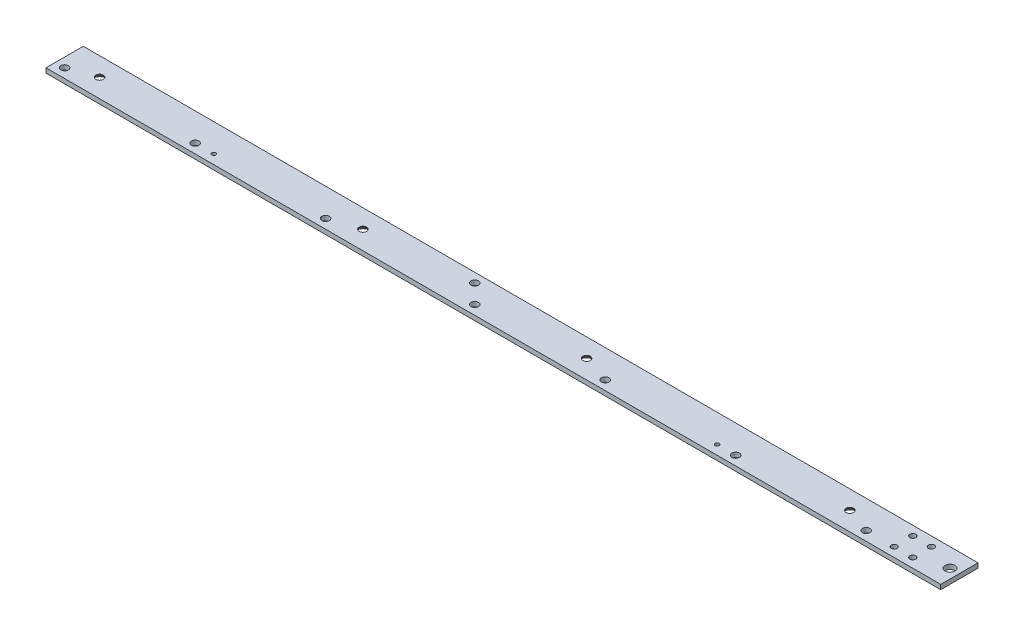
ISO-10303-21;
HEADER;
FILE_DESCRIPTION(('STEP AP214'),'2;1');
FILE_NAME('part.step','',(''),(''),'','','');
FILE_SCHEMA(('AUTOMOTIVE_DESIGN { 1 0 10303 214 1 1 1 1 }'));
ENDSEC;
DATA;
#1=APPLICATION_CONTEXT('core data for automotive mechanical design processes');
#2=APPLICATION_PROTOCOL_DEFINITION('international standard','automotive_design',2000,#1);
#3=PRODUCT_CONTEXT('',#1,'mechanical');
#4=PRODUCT('Part','Part','',(#3));
#5=PRODUCT_RELATED_PRODUCT_CATEGORY('part','',(#4));
#6=PRODUCT_DEFINITION_FORMATION('','',#4);
#7=PRODUCT_DEFINITION_CONTEXT('part definition',#1,'design');
#8=PRODUCT_DEFINITION('design','',#6,#7);
#9=PRODUCT_DEFINITION_SHAPE('','',#8);
#10=(LENGTH_UNIT() NAMED_UNIT(*) SI_UNIT(.MILLI.,.METRE.));
#11=(NAMED_UNIT(*) PLANE_ANGLE_UNIT() SI_UNIT($,.RADIAN.));
#12=(NAMED_UNIT(*) SI_UNIT($,.STERADIAN.) SOLID_ANGLE_UNIT());
#13=UNCERTAINTY_MEASURE_WITH_UNIT(LENGTH_MEASURE(1.E-05),#10,'distance_accuracy_value','');
#14=(GEOMETRIC_REPRESENTATION_CONTEXT(3) GLOBAL_UNCERTAINTY_ASSIGNED_CONTEXT((#13)) GLOBAL_UNIT_ASSIGNED_CONTEXT((#10,
#11,#12)) REPRESENTATION_CONTEXT('',''));
#15=CARTESIAN_POINT('',(0.,0.,0.));
#16=DIRECTION('',(0.,0.,1.));
#17=DIRECTION('',(1.,0.,0.));
#18=AXIS2_PLACEMENT_3D('',#15,#16,#17);
#19=CARTESIAN_POINT('',(279.4,1.5875,12.7));
#20=DIRECTION('',(0.,-1.,0.));
#21=DIRECTION('',(0.,0.,-1.));
#22=AXIS2_PLACEMENT_3D('',#19,#20,#21);
#23=PLANE('',#22);
#24=CARTESIAN_POINT('',(304.8,1.5875,-6.35));
#25=DIRECTION('',(0.,1.,0.));
#26=DIRECTION('',(0.,0.,1.));
#27=AXIS2_PLACEMENT_3D('',#24,#25,#26);
#28=CIRCLE('',#27,2.0193);
#29=CARTESIAN_POINT('',(304.8,1.5875,-4.3307));
#30=VERTEX_POINT('',#29);
#31=EDGE_CURVE('E335',#30,#30,#28,.T.);
#32=ORIENTED_EDGE('',*,*,#31,.F.);
#33=EDGE_LOOP('',(#32));
#34=FACE_BOUND('',#33,.T.);
#35=CARTESIAN_POINT('',(292.1,1.5875,-6.35));
#36=DIRECTION('',(0.,1.,0.));
#37=DIRECTION('',(0.,0.,1.));
#38=AXIS2_PLACEMENT_3D('',#35,#36,#37);
#39=CIRCLE('',#38,2.0193);
#40=CARTESIAN_POINT('',(292.1,1.5875,-4.3307));
#41=VERTEX_POINT('',#40);
#42=EDGE_CURVE('E337',#41,#41,#39,.T.);
#43=ORIENTED_EDGE('',*,*,#42,.F.);
#44=EDGE_LOOP('',(#43));
#45=FACE_BOUND('',#44,.T.);
#46=CARTESIAN_POINT('',(304.8,1.5875,6.35));
#47=DIRECTION('',(0.,1.,0.));
#48=DIRECTION('',(0.,0.,1.));
#49=AXIS2_PLACEMENT_3D('',#46,#47,#48);
#50=CIRCLE('',#49,2.0193);
#51=CARTESIAN_POINT('',(304.8,1.5875,8.3693));
#52=VERTEX_POINT('',#51);
#53=EDGE_CURVE('E345',#52,#52,#50,.T.);
#54=ORIENTED_EDGE('',*,*,#53,.F.);
#55=EDGE_LOOP('',(#54));
#56=FACE_BOUND('',#55,.T.);
#57=CARTESIAN_POINT('',(292.1,1.5875,6.35));
#58=DIRECTION('',(0.,1.,0.));
#59=DIRECTION('',(0.,0.,1.));
#60=AXIS2_PLACEMENT_3D('',#57,#58,#59);
#61=CIRCLE('',#60,2.0193);
#62=CARTESIAN_POINT('',(292.1,1.5875,8.3693));
#63=VERTEX_POINT('',#62);
#64=EDGE_CURVE('E351',#63,#63,#61,.T.);
#65=ORIENTED_EDGE('',*,*,#64,.F.);
#66=EDGE_LOOP('',(#65));
#67=FACE_BOUND('',#66,.T.);
#68=CARTESIAN_POINT('',(323.85,1.5875,0.));
#69=DIRECTION('',(0.,1.,0.));
#70=DIRECTION('',(0.,0.,1.));
#71=AXIS2_PLACEMENT_3D('',#68,#69,#70);
#72=CIRCLE('',#71,3.3782);
#73=CARTESIAN_POINT('',(323.85,1.5875,3.3782));
#74=VERTEX_POINT('',#73);
#75=EDGE_CURVE('E103',#74,#74,#72,.T.);
#76=ORIENTED_EDGE('',*,*,#75,.F.);
#77=EDGE_LOOP('',(#76));
#78=FACE_BOUND('',#77,.T.);
#79=CARTESIAN_POINT('',(-6.35,1.5875,-6.35));
#80=DIRECTION('',(0.,1.,0.));
#81=DIRECTION('',(0.,0.,1.));
#82=AXIS2_PLACEMENT_3D('',#79,#80,#81);
#83=CIRCLE('',#82,2.5527);
#84=CARTESIAN_POINT('',(-6.35,1.5875,-3.7973));
#85=VERTEX_POINT('',#84);
#86=EDGE_CURVE('E109',#85,#85,#83,.T.);
#87=ORIENTED_EDGE('',*,*,#86,.F.);
#88=EDGE_LOOP('',(#87));
#89=FACE_BOUND('',#88,.T.);
#90=CARTESIAN_POINT('',(255.5875,1.5875,0.));
#91=DIRECTION('',(0.,-1.,0.));
#92=DIRECTION('',(0.,0.,-1.));
#93=AXIS2_PLACEMENT_3D('',#90,#91,#92);
#94=CIRCLE('',#93,2.55270000000002);
#95=CARTESIAN_POINT('',(255.5875,1.5875,-2.55270000000002));
#96=VERTEX_POINT('',#95);
#97=EDGE_CURVE('E133',#96,#96,#94,.T.);
#98=ORIENTED_EDGE('',*,*,#97,.T.);
#99=EDGE_LOOP('',(#98));
#100=FACE_BOUND('',#99,.T.);
#101=CARTESIAN_POINT('',(76.2,1.5875,0.));
#102=DIRECTION('',(0.,-1.,0.));
#103=DIRECTION('',(0.,0.,-1.));
#104=AXIS2_PLACEMENT_3D('',#101,#102,#103);
#105=CIRCLE('',#104,2.55270000000001);
#106=CARTESIAN_POINT('',(76.2,1.5875,-2.55270000000001));
#107=VERTEX_POINT('',#106);
#108=EDGE_CURVE('E142',#107,#107,#105,.T.);
#109=ORIENTED_EDGE('',*,*,#108,.T.);
#110=EDGE_LOOP('',(#109));
#111=FACE_BOUND('',#110,.T.);
#112=CARTESIAN_POINT('',(184.15,1.5875,6.35));
#113=DIRECTION('',(0.,1.,0.));
#114=DIRECTION('',(0.,0.,1.));
#115=AXIS2_PLACEMENT_3D('',#112,#113,#114);
#116=CIRCLE('',#115,2.55269999999999);
#117=CARTESIAN_POINT('',(184.15,1.5875,8.90269999999999));
#118=VERTEX_POINT('',#117);
#119=EDGE_CURVE('E151',#118,#118,#116,.T.);
#120=ORIENTED_EDGE('',*,*,#119,.F.);
#121=EDGE_LOOP('',(#120));
#122=FACE_BOUND('',#121,.T.);
#123=CARTESIAN_POINT('',(95.25,1.5875,6.35));
#124=DIRECTION('',(0.,1.,0.));
#125=DIRECTION('',(0.,0.,1.));
#126=AXIS2_PLACEMENT_3D('',#123,#124,#125);
#127=CIRCLE('',#126,2.55269999999999);
#128=CARTESIAN_POINT('',(95.25,1.5875,8.90269999999999));
#129=VERTEX_POINT('',#128);
#130=EDGE_CURVE('E157',#129,#129,#127,.T.);
#131=ORIENTED_EDGE('',*,*,#130,.F.);
#132=EDGE_LOOP('',(#131));
#133=FACE_BOUND('',#132,.T.);
#134=CARTESIAN_POINT('',(-171.45,1.5875,6.35));
#135=DIRECTION('',(0.,1.,0.));
#136=DIRECTION('',(0.,0.,1.));
#137=AXIS2_PLACEMENT_3D('',#134,#135,#136);
#138=CIRCLE('',#137,1.35254999999998);
#139=CARTESIAN_POINT('',(-171.45,1.5875,7.70254999999998));
#140=VERTEX_POINT('',#139);
#141=EDGE_CURVE('E163',#140,#140,#138,.T.);
#142=ORIENTED_EDGE('',*,*,#141,.F.);
#143=EDGE_LOOP('',(#142));
#144=FACE_BOUND('',#143,.T.);
#145=CARTESIAN_POINT('',(-255.5875,1.5875,0.));
#146=DIRECTION('',(0.,-1.,0.));
#147=DIRECTION('',(0.,0.,-1.));
#148=AXIS2_PLACEMENT_3D('',#145,#146,#147);
#149=CIRCLE('',#148,2.55270000000002);
#150=CARTESIAN_POINT('',(-255.5875,1.5875,-2.55270000000002));
#151=VERTEX_POINT('',#150);
#152=EDGE_CURVE('E175',#151,#151,#149,.T.);
#153=ORIENTED_EDGE('',*,*,#152,.T.);
#154=EDGE_LOOP('',(#153));
#155=FACE_BOUND('',#154,.T.);
#156=CARTESIAN_POINT('',(-76.2,1.5875,0.));
#157=DIRECTION('',(0.,-1.,0.));
#158=DIRECTION('',(0.,0.,-1.));
#159=AXIS2_PLACEMENT_3D('',#156,#157,#158);
#160=CIRCLE('',#159,2.55270000000001);
#161=CARTESIAN_POINT('',(-76.2,1.5875,-2.55270000000001));
#162=VERTEX_POINT('',#161);
#163=EDGE_CURVE('E184',#162,#162,#160,.T.);
#164=ORIENTED_EDGE('',*,*,#163,.T.);
#165=EDGE_LOOP('',(#164));
#166=FACE_BOUND('',#165,.T.);
#167=CARTESIAN_POINT('',(-184.15,1.5875,6.35));
#168=DIRECTION('',(0.,1.,0.));
#169=DIRECTION('',(0.,0.,1.));
#170=AXIS2_PLACEMENT_3D('',#167,#168,#169);
#171=CIRCLE('',#170,2.55269999999999);
#172=CARTESIAN_POINT('',(-184.15,1.5875,8.90269999999999));
#173=VERTEX_POINT('',#172);
#174=EDGE_CURVE('E193',#173,#173,#171,.T.);
#175=ORIENTED_EDGE('',*,*,#174,.F.);
#176=EDGE_LOOP('',(#175));
#177=FACE_BOUND('',#176,.T.);
#178=CARTESIAN_POINT('',(-95.25,1.5875,6.35));
#179=DIRECTION('',(0.,1.,0.));
#180=DIRECTION('',(0.,0.,1.));
#181=AXIS2_PLACEMENT_3D('',#178,#179,#180);
#182=CIRCLE('',#181,2.55269999999999);
#183=CARTESIAN_POINT('',(-95.25,1.5875,8.90269999999999));
#184=VERTEX_POINT('',#183);
#185=EDGE_CURVE('E199',#184,#184,#182,.T.);
#186=ORIENTED_EDGE('',*,*,#185,.F.);
#187=EDGE_LOOP('',(#186));
#188=FACE_BOUND('',#187,.T.);
#189=DIRECTION('',(0.,0.,1.));
#190=VECTOR('',#189,1.);
#191=CARTESIAN_POINT('',(-279.4,1.5875,12.7));
#192=LINE('',#191,#190);
#193=CARTESIAN_POINT('',(-279.4,1.5875,-12.7));
#194=VERTEX_POINT('',#193);
#195=CARTESIAN_POINT('',(-279.4,1.5875,12.7));
#196=VERTEX_POINT('',#195);
#197=EDGE_CURVE('E86',#194,#196,#192,.T.);
#198=ORIENTED_EDGE('',*,*,#197,.T.);
#199=DIRECTION('',(-1.,0.,0.));
#200=VECTOR('',#199,1.);
#201=CARTESIAN_POINT('',(279.4,1.5875,12.7));
#202=LINE('',#201,#200);
#203=CARTESIAN_POINT('',(330.2,1.5875,12.7));
#204=VERTEX_POINT('',#203);
#205=EDGE_CURVE('E49',#204,#196,#202,.T.);
#206=ORIENTED_EDGE('',*,*,#205,.F.);
#207=DIRECTION('',(0.,0.,1.));
#208=VECTOR('',#207,1.);
#209=CARTESIAN_POINT('',(330.2,1.5875,-12.7));
#210=LINE('',#209,#208);
#211=CARTESIAN_POINT('',(330.2,1.5875,-12.7));
#212=VERTEX_POINT('',#211);
#213=EDGE_CURVE('E85',#212,#204,#210,.T.);
#214=ORIENTED_EDGE('',*,*,#213,.F.);
#215=DIRECTION('',(-1.,0.,0.));
#216=VECTOR('',#215,1.);
#217=CARTESIAN_POINT('',(279.4,1.5875,-12.7));
#218=LINE('',#217,#216);
#219=EDGE_CURVE('E11',#212,#194,#218,.T.);
#220=ORIENTED_EDGE('',*,*,#219,.T.);
#221=EDGE_LOOP('',(#198,#206,#214,#220));
#222=FACE_BOUND('',#221,.T.);
#223=CARTESIAN_POINT('',(-273.05,1.5875,6.35));
#224=DIRECTION('',(0.,1.,0.));
#225=DIRECTION('',(0.,0.,1.));
#226=AXIS2_PLACEMENT_3D('',#223,#224,#225);
#227=CIRCLE('',#226,2.55269999999996);
#228=CARTESIAN_POINT('',(-273.05,1.5875,8.90269999999996));
#229=VERTEX_POINT('',#228);
#230=EDGE_CURVE('E187',#229,#229,#227,.T.);
#231=ORIENTED_EDGE('',*,*,#230,.F.);
#232=EDGE_LOOP('',(#231));
#233=FACE_BOUND('',#232,.T.);
#234=CARTESIAN_POINT('',(273.05,1.5875,6.35));
#235=DIRECTION('',(0.,1.,0.));
#236=DIRECTION('',(0.,0.,1.));
#237=AXIS2_PLACEMENT_3D('',#234,#235,#236);
#238=CIRCLE('',#237,2.55269999999996);
#239=CARTESIAN_POINT('',(273.05,1.5875,8.90269999999996));
#240=VERTEX_POINT('',#239);
#241=EDGE_CURVE('E145',#240,#240,#238,.T.);
#242=ORIENTED_EDGE('',*,*,#241,.F.);
#243=EDGE_LOOP('',(#242));
#244=FACE_BOUND('',#243,.T.);
#245=CARTESIAN_POINT('',(171.45,1.5875,6.35));
#246=DIRECTION('',(0.,1.,0.));
#247=DIRECTION('',(0.,0.,1.));
#248=AXIS2_PLACEMENT_3D('',#245,#246,#247);
#249=CIRCLE('',#248,1.35254999999998);
#250=CARTESIAN_POINT('',(171.45,1.5875,7.70254999999998));
#251=VERTEX_POINT('',#250);
#252=EDGE_CURVE('E121',#251,#251,#249,.T.);
#253=ORIENTED_EDGE('',*,*,#252,.F.);
#254=EDGE_LOOP('',(#253));
#255=FACE_BOUND('',#254,.T.);
#256=CARTESIAN_POINT('',(6.35,1.5875,6.35));
#257=DIRECTION('',(0.,1.,0.));
#258=DIRECTION('',(0.,0.,1.));
#259=AXIS2_PLACEMENT_3D('',#256,#257,#258);
#260=CIRCLE('',#259,2.5527);
#261=CARTESIAN_POINT('',(6.35,1.5875,8.9027));
#262=VERTEX_POINT('',#261);
#263=EDGE_CURVE('E115',#262,#262,#260,.T.);
#264=ORIENTED_EDGE('',*,*,#263,.F.);
#265=EDGE_LOOP('',(#264));
#266=FACE_BOUND('',#265,.T.);
#267=ADVANCED_FACE('F41',(#34,#45,#56,#67,#78,#89,#100,#111,#122,#133,#144,#155,#166,#177,#188,
#222,#233,#244,#255,#266),#23,.F.);
#268=CARTESIAN_POINT('',(279.4,1.5875,-12.7));
#269=DIRECTION('',(0.,0.,1.));
#270=DIRECTION('',(1.,0.,0.));
#271=AXIS2_PLACEMENT_3D('',#268,#269,#270);
#272=PLANE('',#271);
#273=DIRECTION('',(0.,1.,0.));
#274=VECTOR('',#273,1.);
#275=CARTESIAN_POINT('',(-279.4,1.5875,-12.7));
#276=LINE('',#275,#274);
#277=CARTESIAN_POINT('',(-279.4,-1.5875,-12.7));
#278=VERTEX_POINT('',#277);
#279=EDGE_CURVE('E205',#278,#194,#276,.T.);
#280=ORIENTED_EDGE('',*,*,#279,.T.);
#281=ORIENTED_EDGE('',*,*,#219,.F.);
#282=DIRECTION('',(0.,1.,0.));
#283=VECTOR('',#282,1.);
#284=CARTESIAN_POINT('',(330.2,-1.5875,-12.7));
#285=LINE('',#284,#283);
#286=CARTESIAN_POINT('',(330.2,-1.5875,-12.7));
#287=VERTEX_POINT('',#286);
#288=EDGE_CURVE('E99',#287,#212,#285,.T.);
#289=ORIENTED_EDGE('',*,*,#288,.F.);
#290=DIRECTION('',(-1.,0.,0.));
#291=VECTOR('',#290,1.);
#292=CARTESIAN_POINT('',(279.4,-1.5875,-12.7));
#293=LINE('',#292,#291);
#294=EDGE_CURVE('E211',#287,#278,#293,.T.);
#295=ORIENTED_EDGE('',*,*,#294,.T.);
#296=EDGE_LOOP('',(#280,#281,#289,#295));
#297=FACE_BOUND('',#296,.T.);
#298=ADVANCED_FACE('F43',(#297),#272,.F.);
#299=CARTESIAN_POINT('',(279.4,1.5875,12.7));
#300=DIRECTION('',(0.,0.,-1.));
#301=DIRECTION('',(-1.,0.,0.));
#302=AXIS2_PLACEMENT_3D('',#299,#300,#301);
#303=PLANE('',#302);
#304=DIRECTION('',(0.,-1.,0.));
#305=VECTOR('',#304,1.);
#306=CARTESIAN_POINT('',(-279.4,1.5875,12.7));
#307=LINE('',#306,#305);
#308=CARTESIAN_POINT('',(-279.4,-1.5875,12.7));
#309=VERTEX_POINT('',#308);
#310=EDGE_CURVE('E64',#196,#309,#307,.T.);
#311=ORIENTED_EDGE('',*,*,#310,.T.);
#312=DIRECTION('',(-1.,0.,0.));
#313=VECTOR('',#312,1.);
#314=CARTESIAN_POINT('',(279.4,-1.5875,12.7));
#315=LINE('',#314,#313);
#316=CARTESIAN_POINT('',(330.2,-1.5875,12.7));
#317=VERTEX_POINT('',#316);
#318=EDGE_CURVE('E87',#317,#309,#315,.T.);
#319=ORIENTED_EDGE('',*,*,#318,.F.);
#320=DIRECTION('',(0.,-1.,0.));
#321=VECTOR('',#320,1.);
#322=CARTESIAN_POINT('',(330.2,1.5875,12.7));
#323=LINE('',#322,#321);
#324=EDGE_CURVE('E89',#204,#317,#323,.T.);
#325=ORIENTED_EDGE('',*,*,#324,.F.);
#326=ORIENTED_EDGE('',*,*,#205,.T.);
#327=EDGE_LOOP('',(#311,#319,#325,#326));
#328=FACE_BOUND('',#327,.T.);
#329=ADVANCED_FACE('F90',(#328),#303,.F.);
#330=CARTESIAN_POINT('',(279.4,-1.5875,12.7));
#331=DIRECTION('',(0.,1.,0.));
#332=DIRECTION('',(0.,0.,1.));
#333=AXIS2_PLACEMENT_3D('',#330,#331,#332);
#334=PLANE('',#333);
#335=CARTESIAN_POINT('',(304.8,-1.5875,-6.35));
#336=DIRECTION('',(0.,1.,0.));
#337=DIRECTION('',(0.,0.,1.));
#338=AXIS2_PLACEMENT_3D('',#335,#336,#337);
#339=CIRCLE('',#338,2.0193);
#340=CARTESIAN_POINT('',(304.8,-1.5875,-4.3307));
#341=VERTEX_POINT('',#340);
#342=EDGE_CURVE('E333',#341,#341,#339,.T.);
#343=ORIENTED_EDGE('',*,*,#342,.T.);
#344=EDGE_LOOP('',(#343));
#345=FACE_BOUND('',#344,.T.);
#346=CARTESIAN_POINT('',(292.1,-1.5875,-6.35));
#347=DIRECTION('',(0.,1.,0.));
#348=DIRECTION('',(0.,0.,1.));
#349=AXIS2_PLACEMENT_3D('',#346,#347,#348);
#350=CIRCLE('',#349,2.0193);
#351=CARTESIAN_POINT('',(292.1,-1.5875,-4.3307));
#352=VERTEX_POINT('',#351);
#353=EDGE_CURVE('E342',#352,#352,#350,.T.);
#354=ORIENTED_EDGE('',*,*,#353,.T.);
#355=EDGE_LOOP('',(#354));
#356=FACE_BOUND('',#355,.T.);
#357=CARTESIAN_POINT('',(304.8,-1.5875,6.35));
#358=DIRECTION('',(0.,1.,0.));
#359=DIRECTION('',(0.,0.,1.));
#360=AXIS2_PLACEMENT_3D('',#357,#358,#359);
#361=CIRCLE('',#360,2.0193);
#362=CARTESIAN_POINT('',(304.8,-1.5875,8.3693));
#363=VERTEX_POINT('',#362);
#364=EDGE_CURVE('E348',#363,#363,#361,.T.);
#365=ORIENTED_EDGE('',*,*,#364,.T.);
#366=EDGE_LOOP('',(#365));
#367=FACE_BOUND('',#366,.T.);
#368=CARTESIAN_POINT('',(292.1,-1.5875,6.35));
#369=DIRECTION('',(0.,1.,0.));
#370=DIRECTION('',(0.,0.,1.));
#371=AXIS2_PLACEMENT_3D('',#368,#369,#370);
#372=CIRCLE('',#371,2.0193);
#373=CARTESIAN_POINT('',(292.1,-1.5875,8.3693));
#374=VERTEX_POINT('',#373);
#375=EDGE_CURVE('E354',#374,#374,#372,.T.);
#376=ORIENTED_EDGE('',*,*,#375,.T.);
#377=EDGE_LOOP('',(#376));
#378=FACE_BOUND('',#377,.T.);
#379=CARTESIAN_POINT('',(323.85,-1.5875,0.));
#380=DIRECTION('',(0.,1.,0.));
#381=DIRECTION('',(0.,0.,1.));
#382=AXIS2_PLACEMENT_3D('',#379,#380,#381);
#383=CIRCLE('',#382,3.3782);
#384=CARTESIAN_POINT('',(323.85,-1.5875,3.3782));
#385=VERTEX_POINT('',#384);
#386=EDGE_CURVE('E100',#385,#385,#383,.T.);
#387=ORIENTED_EDGE('',*,*,#386,.T.);
#388=EDGE_LOOP('',(#387));
#389=FACE_BOUND('',#388,.T.);
#390=CARTESIAN_POINT('',(-6.35,-1.5875,-6.35));
#391=DIRECTION('',(0.,1.,0.));
#392=DIRECTION('',(0.,0.,1.));
#393=AXIS2_PLACEMENT_3D('',#390,#391,#392);
#394=CIRCLE('',#393,2.5527);
#395=CARTESIAN_POINT('',(-6.35,-1.5875,-3.7973));
#396=VERTEX_POINT('',#395);
#397=EDGE_CURVE('E112',#396,#396,#394,.T.);
#398=ORIENTED_EDGE('',*,*,#397,.T.);
#399=EDGE_LOOP('',(#398));
#400=FACE_BOUND('',#399,.T.);
#401=CARTESIAN_POINT('',(6.35,-1.5875,6.35));
#402=DIRECTION('',(0.,1.,0.));
#403=DIRECTION('',(0.,0.,1.));
#404=AXIS2_PLACEMENT_3D('',#401,#402,#403);
#405=CIRCLE('',#404,2.5527);
#406=CARTESIAN_POINT('',(6.35,-1.5875,8.9027));
#407=VERTEX_POINT('',#406);
#408=EDGE_CURVE('E118',#407,#407,#405,.T.);
#409=ORIENTED_EDGE('',*,*,#408,.T.);
#410=EDGE_LOOP('',(#409));
#411=FACE_BOUND('',#410,.T.);
#412=CARTESIAN_POINT('',(171.45,-1.5875,6.35));
#413=DIRECTION('',(0.,1.,0.));
#414=DIRECTION('',(0.,0.,1.));
#415=AXIS2_PLACEMENT_3D('',#412,#413,#414);
#416=CIRCLE('',#415,1.35255000000001);
#417=CARTESIAN_POINT('',(171.45,-1.5875,7.70255000000001));
#418=VERTEX_POINT('',#417);
#419=EDGE_CURVE('E124',#418,#418,#416,.T.);
#420=ORIENTED_EDGE('',*,*,#419,.T.);
#421=EDGE_LOOP('',(#420));
#422=FACE_BOUND('',#421,.T.);
#423=CARTESIAN_POINT('',(255.5875,-1.5875,0.));
#424=DIRECTION('',(0.,-1.,0.));
#425=DIRECTION('',(0.,0.,-1.));
#426=AXIS2_PLACEMENT_3D('',#423,#424,#425);
#427=CIRCLE('',#426,4.88949999999999);
#428=CARTESIAN_POINT('',(255.5875,-1.5875,-4.88949999999999));
#429=VERTEX_POINT('',#428);
#430=EDGE_CURVE('E127',#429,#429,#427,.T.);
#431=ORIENTED_EDGE('',*,*,#430,.F.);
#432=EDGE_LOOP('',(#431));
#433=FACE_BOUND('',#432,.T.);
#434=CARTESIAN_POINT('',(76.2,-1.5875,0.));
#435=DIRECTION('',(0.,-1.,0.));
#436=DIRECTION('',(0.,0.,-1.));
#437=AXIS2_PLACEMENT_3D('',#434,#435,#436);
#438=CIRCLE('',#437,4.88950000000001);
#439=CARTESIAN_POINT('',(76.2,-1.5875,-4.88950000000001));
#440=VERTEX_POINT('',#439);
#441=EDGE_CURVE('E136',#440,#440,#438,.T.);
#442=ORIENTED_EDGE('',*,*,#441,.F.);
#443=EDGE_LOOP('',(#442));
#444=FACE_BOUND('',#443,.T.);
#445=CARTESIAN_POINT('',(273.05,-1.5875,6.35));
#446=DIRECTION('',(0.,1.,0.));
#447=DIRECTION('',(0.,0.,1.));
#448=AXIS2_PLACEMENT_3D('',#445,#446,#447);
#449=CIRCLE('',#448,2.55270000000002);
#450=CARTESIAN_POINT('',(273.05,-1.5875,8.90270000000002));
#451=VERTEX_POINT('',#450);
#452=EDGE_CURVE('E148',#451,#451,#449,.T.);
#453=ORIENTED_EDGE('',*,*,#452,.T.);
#454=EDGE_LOOP('',(#453));
#455=FACE_BOUND('',#454,.T.);
#456=CARTESIAN_POINT('',(184.15,-1.5875,6.35));
#457=DIRECTION('',(0.,1.,0.));
#458=DIRECTION('',(0.,0.,1.));
#459=AXIS2_PLACEMENT_3D('',#456,#457,#458);
#460=CIRCLE('',#459,2.55269999999999);
#461=CARTESIAN_POINT('',(184.15,-1.5875,8.90269999999999));
#462=VERTEX_POINT('',#461);
#463=EDGE_CURVE('E154',#462,#462,#460,.T.);
#464=ORIENTED_EDGE('',*,*,#463,.T.);
#465=EDGE_LOOP('',(#464));
#466=FACE_BOUND('',#465,.T.);
#467=CARTESIAN_POINT('',(95.25,-1.5875,6.35));
#468=DIRECTION('',(0.,1.,0.));
#469=DIRECTION('',(0.,0.,1.));
#470=AXIS2_PLACEMENT_3D('',#467,#468,#469);
#471=CIRCLE('',#470,2.55270000000001);
#472=CARTESIAN_POINT('',(95.25,-1.5875,8.9027));
#473=VERTEX_POINT('',#472);
#474=EDGE_CURVE('E160',#473,#473,#471,.T.);
#475=ORIENTED_EDGE('',*,*,#474,.T.);
#476=EDGE_LOOP('',(#475));
#477=FACE_BOUND('',#476,.T.);
#478=CARTESIAN_POINT('',(-171.45,-1.5875,6.35));
#479=DIRECTION('',(0.,1.,0.));
#480=DIRECTION('',(0.,0.,1.));
#481=AXIS2_PLACEMENT_3D('',#478,#479,#480);
#482=CIRCLE('',#481,1.35255000000001);
#483=CARTESIAN_POINT('',(-171.45,-1.5875,7.70255000000001));
#484=VERTEX_POINT('',#483);
#485=EDGE_CURVE('E166',#484,#484,#482,.T.);
#486=ORIENTED_EDGE('',*,*,#485,.T.);
#487=EDGE_LOOP('',(#486));
#488=FACE_BOUND('',#487,.T.);
#489=CARTESIAN_POINT('',(-255.5875,-1.5875,0.));
#490=DIRECTION('',(0.,-1.,0.));
#491=DIRECTION('',(0.,0.,-1.));
#492=AXIS2_PLACEMENT_3D('',#489,#490,#491);
#493=CIRCLE('',#492,4.88949999999999);
#494=CARTESIAN_POINT('',(-255.5875,-1.5875,-4.88949999999999));
#495=VERTEX_POINT('',#494);
#496=EDGE_CURVE('E169',#495,#495,#493,.T.);
#497=ORIENTED_EDGE('',*,*,#496,.F.);
#498=EDGE_LOOP('',(#497));
#499=FACE_BOUND('',#498,.T.);
#500=CARTESIAN_POINT('',(-76.2,-1.5875,0.));
#501=DIRECTION('',(0.,-1.,0.));
#502=DIRECTION('',(0.,0.,-1.));
#503=AXIS2_PLACEMENT_3D('',#500,#501,#502);
#504=CIRCLE('',#503,4.88950000000001);
#505=CARTESIAN_POINT('',(-76.2,-1.5875,-4.88950000000001));
#506=VERTEX_POINT('',#505);
#507=EDGE_CURVE('E178',#506,#506,#504,.T.);
#508=ORIENTED_EDGE('',*,*,#507,.F.);
#509=EDGE_LOOP('',(#508));
#510=FACE_BOUND('',#509,.T.);
#511=CARTESIAN_POINT('',(-273.05,-1.5875,6.35));
#512=DIRECTION('',(0.,1.,0.));
#513=DIRECTION('',(0.,0.,1.));
#514=AXIS2_PLACEMENT_3D('',#511,#512,#513);
#515=CIRCLE('',#514,2.55270000000002);
#516=CARTESIAN_POINT('',(-273.05,-1.5875,8.90270000000002));
#517=VERTEX_POINT('',#516);
#518=EDGE_CURVE('E190',#517,#517,#515,.T.);
#519=ORIENTED_EDGE('',*,*,#518,.T.);
#520=EDGE_LOOP('',(#519));
#521=FACE_BOUND('',#520,.T.);
#522=CARTESIAN_POINT('',(-184.15,-1.5875,6.35));
#523=DIRECTION('',(0.,1.,0.));
#524=DIRECTION('',(0.,0.,1.));
#525=AXIS2_PLACEMENT_3D('',#522,#523,#524);
#526=CIRCLE('',#525,2.55269999999999);
#527=CARTESIAN_POINT('',(-184.15,-1.5875,8.90269999999999));
#528=VERTEX_POINT('',#527);
#529=EDGE_CURVE('E196',#528,#528,#526,.T.);
#530=ORIENTED_EDGE('',*,*,#529,.T.);
#531=EDGE_LOOP('',(#530));
#532=FACE_BOUND('',#531,.T.);
#533=CARTESIAN_POINT('',(-95.25,-1.5875,6.35));
#534=DIRECTION('',(0.,1.,0.));
#535=DIRECTION('',(0.,0.,1.));
#536=AXIS2_PLACEMENT_3D('',#533,#534,#535);
#537=CIRCLE('',#536,2.55270000000001);
#538=CARTESIAN_POINT('',(-95.25,-1.5875,8.9027));
#539=VERTEX_POINT('',#538);
#540=EDGE_CURVE('E202',#539,#539,#537,.T.);
#541=ORIENTED_EDGE('',*,*,#540,.T.);
#542=EDGE_LOOP('',(#541));
#543=FACE_BOUND('',#542,.T.);
#544=DIRECTION('',(0.,0.,-1.));
#545=VECTOR('',#544,1.);
#546=CARTESIAN_POINT('',(-279.4,-1.5875,12.7));
#547=LINE('',#546,#545);
#548=EDGE_CURVE('E56',#309,#278,#547,.T.);
#549=ORIENTED_EDGE('',*,*,#548,.T.);
#550=ORIENTED_EDGE('',*,*,#294,.F.);
#551=DIRECTION('',(0.,0.,-1.));
#552=VECTOR('',#551,1.);
#553=CARTESIAN_POINT('',(330.2,-1.5875,12.7));
#554=LINE('',#553,#552);
#555=EDGE_CURVE('E94',#317,#287,#554,.T.);
#556=ORIENTED_EDGE('',*,*,#555,.F.);
#557=ORIENTED_EDGE('',*,*,#318,.T.);
#558=EDGE_LOOP('',(#549,#550,#556,#557));
#559=FACE_BOUND('',#558,.T.);
#560=ADVANCED_FACE('F213',(#345,#356,#367,#378,#389,#400,#411,#422,#433,#444,#455,#466,#477,
#488,#499,#510,#521,#532,#543,#559),#334,.F.);
#561=CARTESIAN_POINT('',(-279.4,0.,0.));
#562=DIRECTION('',(1.,0.,0.));
#563=DIRECTION('',(0.,0.,-1.));
#564=AXIS2_PLACEMENT_3D('',#561,#562,#563);
#565=PLANE('',#564);
#566=ORIENTED_EDGE('',*,*,#279,.F.);
#567=ORIENTED_EDGE('',*,*,#548,.F.);
#568=ORIENTED_EDGE('',*,*,#310,.F.);
#569=ORIENTED_EDGE('',*,*,#197,.F.);
#570=EDGE_LOOP('',(#566,#567,#568,#569));
#571=FACE_BOUND('',#570,.T.);
#572=ADVANCED_FACE('F216',(#571),#565,.F.);
#573=CARTESIAN_POINT('',(-95.25,1.5875,6.35));
#574=DIRECTION('',(0.,1.,0.));
#575=DIRECTION('',(0.,0.,1.));
#576=AXIS2_PLACEMENT_3D('',#573,#574,#575);
#577=CYLINDRICAL_SURFACE('',#576,2.5527);
#578=ORIENTED_EDGE('',*,*,#540,.F.);
#579=EDGE_LOOP('',(#578));
#580=FACE_BOUND('',#579,.T.);
#581=ORIENTED_EDGE('',*,*,#185,.T.);
#582=EDGE_LOOP('',(#581));
#583=FACE_BOUND('',#582,.T.);
#584=ADVANCED_FACE('F235',(#580,#583),#577,.F.);
#585=CARTESIAN_POINT('',(-184.15,1.5875,6.35));
#586=DIRECTION('',(0.,1.,0.));
#587=DIRECTION('',(0.,0.,1.));
#588=AXIS2_PLACEMENT_3D('',#585,#586,#587);
#589=CYLINDRICAL_SURFACE('',#588,2.55269999999999);
#590=ORIENTED_EDGE('',*,*,#529,.F.);
#591=EDGE_LOOP('',(#590));
#592=FACE_BOUND('',#591,.T.);
#593=ORIENTED_EDGE('',*,*,#174,.T.);
#594=EDGE_LOOP('',(#593));
#595=FACE_BOUND('',#594,.T.);
#596=ADVANCED_FACE('F238',(#592,#595),#589,.F.);
#597=CARTESIAN_POINT('',(-273.05,1.5875,6.35));
#598=DIRECTION('',(0.,1.,0.));
#599=DIRECTION('',(0.,0.,1.));
#600=AXIS2_PLACEMENT_3D('',#597,#598,#599);
#601=CYLINDRICAL_SURFACE('',#600,2.55269999999999);
#602=ORIENTED_EDGE('',*,*,#518,.F.);
#603=EDGE_LOOP('',(#602));
#604=FACE_BOUND('',#603,.T.);
#605=ORIENTED_EDGE('',*,*,#230,.T.);
#606=EDGE_LOOP('',(#605));
#607=FACE_BOUND('',#606,.T.);
#608=ADVANCED_FACE('F242',(#604,#607),#601,.F.);
#609=CARTESIAN_POINT('',(-76.2,-1.5875,0.));
#610=DIRECTION('',(0.,-1.,0.));
#611=DIRECTION('',(0.,0.,-1.));
#612=AXIS2_PLACEMENT_3D('',#609,#610,#611);
#613=CYLINDRICAL_SURFACE('',#612,2.55270000000001);
#614=ORIENTED_EDGE('',*,*,#163,.F.);
#615=EDGE_LOOP('',(#614));
#616=FACE_BOUND('',#615,.T.);
#617=CARTESIAN_POINT('',(-76.2,1.10068089399406,0.));
#618=DIRECTION('',(0.,-1.,0.));
#619=DIRECTION('',(0.,0.,-1.));
#620=AXIS2_PLACEMENT_3D('',#617,#618,#619);
#621=CIRCLE('',#620,2.55270000000001);
#622=CARTESIAN_POINT('',(-76.2,1.10068089399406,-2.55270000000001));
#623=VERTEX_POINT('',#622);
#624=EDGE_CURVE('E181',#623,#623,#621,.T.);
#625=ORIENTED_EDGE('',*,*,#624,.T.);
#626=EDGE_LOOP('',(#625));
#627=FACE_BOUND('',#626,.T.);
#628=ADVANCED_FACE('F246',(#616,#627),#613,.F.);
#629=CARTESIAN_POINT('',(-76.2,-1.5875,0.));
#630=DIRECTION('',(0.,-1.,0.));
#631=DIRECTION('',(0.,0.,-1.));
#632=AXIS2_PLACEMENT_3D('',#629,#630,#631);
#633=CONICAL_SURFACE('',#632,4.88950000000001,0.715584993317675);
#634=ORIENTED_EDGE('',*,*,#624,.F.);
#635=EDGE_LOOP('',(#634));
#636=FACE_BOUND('',#635,.T.);
#637=ORIENTED_EDGE('',*,*,#507,.T.);
#638=EDGE_LOOP('',(#637));
#639=FACE_BOUND('',#638,.T.);
#640=ADVANCED_FACE('F250',(#636,#639),#633,.F.);
#641=CARTESIAN_POINT('',(-255.5875,-1.5875,0.));
#642=DIRECTION('',(0.,-1.,0.));
#643=DIRECTION('',(0.,0.,-1.));
#644=AXIS2_PLACEMENT_3D('',#641,#642,#643);
#645=CYLINDRICAL_SURFACE('',#644,2.55270000000002);
#646=ORIENTED_EDGE('',*,*,#152,.F.);
#647=EDGE_LOOP('',(#646));
#648=FACE_BOUND('',#647,.T.);
#649=CARTESIAN_POINT('',(-255.5875,1.10068089399406,0.));
#650=DIRECTION('',(0.,-1.,0.));
#651=DIRECTION('',(0.,0.,-1.));
#652=AXIS2_PLACEMENT_3D('',#649,#650,#651);
#653=CIRCLE('',#652,2.55270000000002);
#654=CARTESIAN_POINT('',(-255.5875,1.10068089399406,-2.55270000000002));
#655=VERTEX_POINT('',#654);
#656=EDGE_CURVE('E172',#655,#655,#653,.T.);
#657=ORIENTED_EDGE('',*,*,#656,.T.);
#658=EDGE_LOOP('',(#657));
#659=FACE_BOUND('',#658,.T.);
#660=ADVANCED_FACE('F254',(#648,#659),#645,.F.);
#661=CARTESIAN_POINT('',(-255.5875,-1.5875,0.));
#662=DIRECTION('',(0.,-1.,0.));
#663=DIRECTION('',(0.,0.,-1.));
#664=AXIS2_PLACEMENT_3D('',#661,#662,#663);
#665=CONICAL_SURFACE('',#664,4.88949999999999,0.715584993317669);
#666=ORIENTED_EDGE('',*,*,#656,.F.);
#667=EDGE_LOOP('',(#666));
#668=FACE_BOUND('',#667,.T.);
#669=ORIENTED_EDGE('',*,*,#496,.T.);
#670=EDGE_LOOP('',(#669));
#671=FACE_BOUND('',#670,.T.);
#672=ADVANCED_FACE('F258',(#668,#671),#665,.F.);
#673=CARTESIAN_POINT('',(-171.45,1.5875,6.35));
#674=DIRECTION('',(0.,1.,0.));
#675=DIRECTION('',(0.,0.,1.));
#676=AXIS2_PLACEMENT_3D('',#673,#674,#675);
#677=CYLINDRICAL_SURFACE('',#676,1.35254999999999);
#678=ORIENTED_EDGE('',*,*,#485,.F.);
#679=EDGE_LOOP('',(#678));
#680=FACE_BOUND('',#679,.T.);
#681=ORIENTED_EDGE('',*,*,#141,.T.);
#682=EDGE_LOOP('',(#681));
#683=FACE_BOUND('',#682,.T.);
#684=ADVANCED_FACE('F262',(#680,#683),#677,.F.);
#685=CARTESIAN_POINT('',(95.25,1.5875,6.35));
#686=DIRECTION('',(0.,1.,0.));
#687=DIRECTION('',(0.,0.,1.));
#688=AXIS2_PLACEMENT_3D('',#685,#686,#687);
#689=CYLINDRICAL_SURFACE('',#688,2.5527);
#690=ORIENTED_EDGE('',*,*,#474,.F.);
#691=EDGE_LOOP('',(#690));
#692=FACE_BOUND('',#691,.T.);
#693=ORIENTED_EDGE('',*,*,#130,.T.);
#694=EDGE_LOOP('',(#693));
#695=FACE_BOUND('',#694,.T.);
#696=ADVANCED_FACE('F266',(#692,#695),#689,.F.);
#697=CARTESIAN_POINT('',(184.15,1.5875,6.35));
#698=DIRECTION('',(0.,1.,0.));
#699=DIRECTION('',(0.,0.,1.));
#700=AXIS2_PLACEMENT_3D('',#697,#698,#699);
#701=CYLINDRICAL_SURFACE('',#700,2.55269999999999);
#702=ORIENTED_EDGE('',*,*,#463,.F.);
#703=EDGE_LOOP('',(#702));
#704=FACE_BOUND('',#703,.T.);
#705=ORIENTED_EDGE('',*,*,#119,.T.);
#706=EDGE_LOOP('',(#705));
#707=FACE_BOUND('',#706,.T.);
#708=ADVANCED_FACE('F270',(#704,#707),#701,.F.);
#709=CARTESIAN_POINT('',(273.05,1.5875,6.35));
#710=DIRECTION('',(0.,1.,0.));
#711=DIRECTION('',(0.,0.,1.));
#712=AXIS2_PLACEMENT_3D('',#709,#710,#711);
#713=CYLINDRICAL_SURFACE('',#712,2.55269999999999);
#714=ORIENTED_EDGE('',*,*,#452,.F.);
#715=EDGE_LOOP('',(#714));
#716=FACE_BOUND('',#715,.T.);
#717=ORIENTED_EDGE('',*,*,#241,.T.);
#718=EDGE_LOOP('',(#717));
#719=FACE_BOUND('',#718,.T.);
#720=ADVANCED_FACE('F274',(#716,#719),#713,.F.);
#721=CARTESIAN_POINT('',(76.2,-1.5875,0.));
#722=DIRECTION('',(0.,-1.,0.));
#723=DIRECTION('',(0.,0.,-1.));
#724=AXIS2_PLACEMENT_3D('',#721,#722,#723);
#725=CYLINDRICAL_SURFACE('',#724,2.55270000000001);
#726=ORIENTED_EDGE('',*,*,#108,.F.);
#727=EDGE_LOOP('',(#726));
#728=FACE_BOUND('',#727,.T.);
#729=CARTESIAN_POINT('',(76.2,1.10068089399406,0.));
#730=DIRECTION('',(0.,-1.,0.));
#731=DIRECTION('',(0.,0.,-1.));
#732=AXIS2_PLACEMENT_3D('',#729,#730,#731);
#733=CIRCLE('',#732,2.55270000000001);
#734=CARTESIAN_POINT('',(76.2,1.10068089399406,-2.55270000000001));
#735=VERTEX_POINT('',#734);
#736=EDGE_CURVE('E139',#735,#735,#733,.T.);
#737=ORIENTED_EDGE('',*,*,#736,.T.);
#738=EDGE_LOOP('',(#737));
#739=FACE_BOUND('',#738,.T.);
#740=ADVANCED_FACE('F278',(#728,#739),#725,.F.);
#741=CARTESIAN_POINT('',(76.2,-1.5875,0.));
#742=DIRECTION('',(0.,-1.,0.));
#743=DIRECTION('',(0.,0.,-1.));
#744=AXIS2_PLACEMENT_3D('',#741,#742,#743);
#745=CONICAL_SURFACE('',#744,4.88950000000001,0.715584993317675);
#746=ORIENTED_EDGE('',*,*,#736,.F.);
#747=EDGE_LOOP('',(#746));
#748=FACE_BOUND('',#747,.T.);
#749=ORIENTED_EDGE('',*,*,#441,.T.);
#750=EDGE_LOOP('',(#749));
#751=FACE_BOUND('',#750,.T.);
#752=ADVANCED_FACE('F282',(#748,#751),#745,.F.);
#753=CARTESIAN_POINT('',(255.5875,-1.5875,0.));
#754=DIRECTION('',(0.,-1.,0.));
#755=DIRECTION('',(0.,0.,-1.));
#756=AXIS2_PLACEMENT_3D('',#753,#754,#755);
#757=CYLINDRICAL_SURFACE('',#756,2.55270000000002);
#758=ORIENTED_EDGE('',*,*,#97,.F.);
#759=EDGE_LOOP('',(#758));
#760=FACE_BOUND('',#759,.T.);
#761=CARTESIAN_POINT('',(255.5875,1.10068089399406,0.));
#762=DIRECTION('',(0.,-1.,0.));
#763=DIRECTION('',(0.,0.,-1.));
#764=AXIS2_PLACEMENT_3D('',#761,#762,#763);
#765=CIRCLE('',#764,2.55270000000002);
#766=CARTESIAN_POINT('',(255.5875,1.10068089399406,-2.55270000000002));
#767=VERTEX_POINT('',#766);
#768=EDGE_CURVE('E130',#767,#767,#765,.T.);
#769=ORIENTED_EDGE('',*,*,#768,.T.);
#770=EDGE_LOOP('',(#769));
#771=FACE_BOUND('',#770,.T.);
#772=ADVANCED_FACE('F286',(#760,#771),#757,.F.);
#773=CARTESIAN_POINT('',(255.5875,-1.5875,0.));
#774=DIRECTION('',(0.,-1.,0.));
#775=DIRECTION('',(0.,0.,-1.));
#776=AXIS2_PLACEMENT_3D('',#773,#774,#775);
#777=CONICAL_SURFACE('',#776,4.88949999999999,0.715584993317669);
#778=ORIENTED_EDGE('',*,*,#768,.F.);
#779=EDGE_LOOP('',(#778));
#780=FACE_BOUND('',#779,.T.);
#781=ORIENTED_EDGE('',*,*,#430,.T.);
#782=EDGE_LOOP('',(#781));
#783=FACE_BOUND('',#782,.T.);
#784=ADVANCED_FACE('F290',(#780,#783),#777,.F.);
#785=CARTESIAN_POINT('',(171.45,1.5875,6.35));
#786=DIRECTION('',(0.,1.,0.));
#787=DIRECTION('',(0.,0.,1.));
#788=AXIS2_PLACEMENT_3D('',#785,#786,#787);
#789=CYLINDRICAL_SURFACE('',#788,1.35254999999999);
#790=ORIENTED_EDGE('',*,*,#419,.F.);
#791=EDGE_LOOP('',(#790));
#792=FACE_BOUND('',#791,.T.);
#793=ORIENTED_EDGE('',*,*,#252,.T.);
#794=EDGE_LOOP('',(#793));
#795=FACE_BOUND('',#794,.T.);
#796=ADVANCED_FACE('F294',(#792,#795),#789,.F.);
#797=CARTESIAN_POINT('',(6.35,1.5875,6.35));
#798=DIRECTION('',(0.,1.,0.));
#799=DIRECTION('',(0.,0.,1.));
#800=AXIS2_PLACEMENT_3D('',#797,#798,#799);
#801=CYLINDRICAL_SURFACE('',#800,2.5527);
#802=ORIENTED_EDGE('',*,*,#408,.F.);
#803=EDGE_LOOP('',(#802));
#804=FACE_BOUND('',#803,.T.);
#805=ORIENTED_EDGE('',*,*,#263,.T.);
#806=EDGE_LOOP('',(#805));
#807=FACE_BOUND('',#806,.T.);
#808=ADVANCED_FACE('F298',(#804,#807),#801,.F.);
#809=CARTESIAN_POINT('',(-6.35,1.5875,-6.35));
#810=DIRECTION('',(0.,1.,0.));
#811=DIRECTION('',(0.,0.,1.));
#812=AXIS2_PLACEMENT_3D('',#809,#810,#811);
#813=CYLINDRICAL_SURFACE('',#812,2.5527);
#814=ORIENTED_EDGE('',*,*,#397,.F.);
#815=EDGE_LOOP('',(#814));
#816=FACE_BOUND('',#815,.T.);
#817=ORIENTED_EDGE('',*,*,#86,.T.);
#818=EDGE_LOOP('',(#817));
#819=FACE_BOUND('',#818,.T.);
#820=ADVANCED_FACE('F302',(#816,#819),#813,.F.);
#821=CARTESIAN_POINT('',(330.2,0.,0.));
#822=DIRECTION('',(1.,0.,0.));
#823=DIRECTION('',(0.,0.,-1.));
#824=AXIS2_PLACEMENT_3D('',#821,#822,#823);
#825=PLANE('',#824);
#826=ORIENTED_EDGE('',*,*,#213,.T.);
#827=ORIENTED_EDGE('',*,*,#324,.T.);
#828=ORIENTED_EDGE('',*,*,#555,.T.);
#829=ORIENTED_EDGE('',*,*,#288,.T.);
#830=EDGE_LOOP('',(#826,#827,#828,#829));
#831=FACE_BOUND('',#830,.T.);
#832=ADVANCED_FACE('F97',(#831),#825,.T.);
#833=CARTESIAN_POINT('',(323.85,1.5875,0.));
#834=DIRECTION('',(0.,1.,0.));
#835=DIRECTION('',(0.,0.,1.));
#836=AXIS2_PLACEMENT_3D('',#833,#834,#835);
#837=CYLINDRICAL_SURFACE('',#836,3.3782);
#838=ORIENTED_EDGE('',*,*,#386,.F.);
#839=EDGE_LOOP('',(#838));
#840=FACE_BOUND('',#839,.T.);
#841=ORIENTED_EDGE('',*,*,#75,.T.);
#842=EDGE_LOOP('',(#841));
#843=FACE_BOUND('',#842,.T.);
#844=ADVANCED_FACE('F309',(#840,#843),#837,.F.);
#845=CARTESIAN_POINT('',(292.1,1.5875,6.35));
#846=DIRECTION('',(0.,1.,0.));
#847=DIRECTION('',(0.,0.,1.));
#848=AXIS2_PLACEMENT_3D('',#845,#846,#847);
#849=CYLINDRICAL_SURFACE('',#848,2.0193);
#850=ORIENTED_EDGE('',*,*,#375,.F.);
#851=EDGE_LOOP('',(#850));
#852=FACE_BOUND('',#851,.T.);
#853=ORIENTED_EDGE('',*,*,#64,.T.);
#854=EDGE_LOOP('',(#853));
#855=FACE_BOUND('',#854,.T.);
#856=ADVANCED_FACE('F312',(#852,#855),#849,.F.);
#857=CARTESIAN_POINT('',(304.8,1.5875,6.35));
#858=DIRECTION('',(0.,1.,0.));
#859=DIRECTION('',(0.,0.,1.));
#860=AXIS2_PLACEMENT_3D('',#857,#858,#859);
#861=CYLINDRICAL_SURFACE('',#860,2.0193);
#862=ORIENTED_EDGE('',*,*,#364,.F.);
#863=EDGE_LOOP('',(#862));
#864=FACE_BOUND('',#863,.T.);
#865=ORIENTED_EDGE('',*,*,#53,.T.);
#866=EDGE_LOOP('',(#865));
#867=FACE_BOUND('',#866,.T.);
#868=ADVANCED_FACE('F316',(#864,#867),#861,.F.);
#869=CARTESIAN_POINT('',(292.1,1.5875,-6.35));
#870=DIRECTION('',(0.,1.,0.));
#871=DIRECTION('',(0.,0.,1.));
#872=AXIS2_PLACEMENT_3D('',#869,#870,#871);
#873=CYLINDRICAL_SURFACE('',#872,2.0193);
#874=ORIENTED_EDGE('',*,*,#353,.F.);
#875=EDGE_LOOP('',(#874));
#876=FACE_BOUND('',#875,.T.);
#877=ORIENTED_EDGE('',*,*,#42,.T.);
#878=EDGE_LOOP('',(#877));
#879=FACE_BOUND('',#878,.T.);
#880=ADVANCED_FACE('F320',(#876,#879),#873,.F.);
#881=CARTESIAN_POINT('',(304.8,1.5875,-6.35));
#882=DIRECTION('',(0.,1.,0.));
#883=DIRECTION('',(0.,0.,1.));
#884=AXIS2_PLACEMENT_3D('',#881,#882,#883);
#885=CYLINDRICAL_SURFACE('',#884,2.0193);
#886=ORIENTED_EDGE('',*,*,#342,.F.);
#887=EDGE_LOOP('',(#886));
#888=FACE_BOUND('',#887,.T.);
#889=ORIENTED_EDGE('',*,*,#31,.T.);
#890=EDGE_LOOP('',(#889));
#891=FACE_BOUND('',#890,.T.);
#892=ADVANCED_FACE('F324',(#888,#891),#885,.F.);
#893=CLOSED_SHELL('',(#267,#298,#329,#560,#572,#584,#596,#608,#628,#640,#660,#672,#684,#696,
#708,#720,#740,#752,#772,#784,#796,#808,#820,#832,#844,#856,#868,#880,#892));
#894=MANIFOLD_SOLID_BREP('B2',#893);
#895=ADVANCED_BREP_SHAPE_REPRESENTATION('',(#18,#894),#14);
#896=SHAPE_DEFINITION_REPRESENTATION(#9,#895);
ENDSEC;
END-ISO-10303-21;
